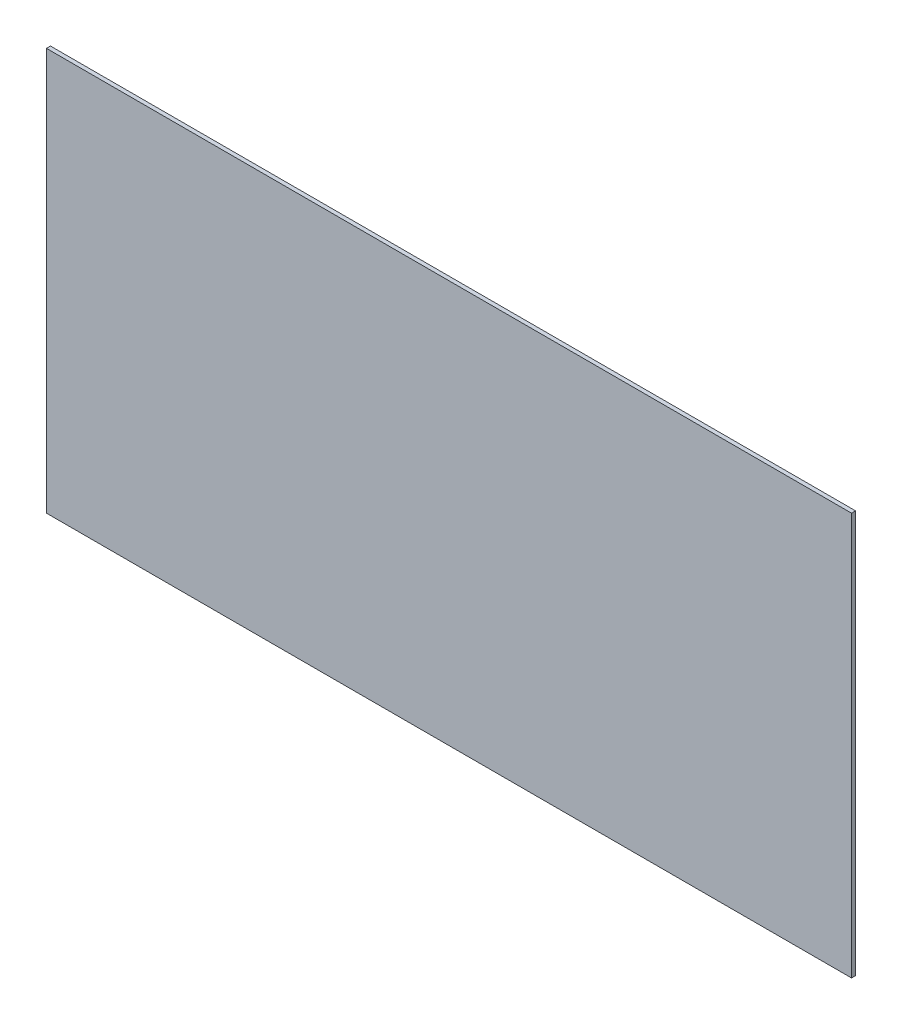
ISO-10303-21;
HEADER;
FILE_DESCRIPTION(('STEP AP214'),'2;1');
FILE_NAME('part.step','',(''),(''),'','','');
FILE_SCHEMA(('AUTOMOTIVE_DESIGN { 1 0 10303 214 1 1 1 1 }'));
ENDSEC;
DATA;
#1=APPLICATION_CONTEXT('core data for automotive mechanical design processes');
#2=APPLICATION_PROTOCOL_DEFINITION('international standard','automotive_design',2000,#1);
#3=PRODUCT_CONTEXT('',#1,'mechanical');
#4=PRODUCT('Part','Part','',(#3));
#5=PRODUCT_RELATED_PRODUCT_CATEGORY('part','',(#4));
#6=PRODUCT_DEFINITION_FORMATION('','',#4);
#7=PRODUCT_DEFINITION_CONTEXT('part definition',#1,'design');
#8=PRODUCT_DEFINITION('design','',#6,#7);
#9=PRODUCT_DEFINITION_SHAPE('','',#8);
#10=(LENGTH_UNIT() NAMED_UNIT(*) SI_UNIT(.MILLI.,.METRE.));
#11=(NAMED_UNIT(*) PLANE_ANGLE_UNIT() SI_UNIT($,.RADIAN.));
#12=(NAMED_UNIT(*) SI_UNIT($,.STERADIAN.) SOLID_ANGLE_UNIT());
#13=UNCERTAINTY_MEASURE_WITH_UNIT(LENGTH_MEASURE(1.E-05),#10,'distance_accuracy_value','');
#14=(GEOMETRIC_REPRESENTATION_CONTEXT(3) GLOBAL_UNCERTAINTY_ASSIGNED_CONTEXT((#13)) GLOBAL_UNIT_ASSIGNED_CONTEXT((#10,
#11,#12)) REPRESENTATION_CONTEXT('',''));
#15=CARTESIAN_POINT('',(0.,0.,0.));
#16=DIRECTION('',(0.,0.,1.));
#17=DIRECTION('',(1.,0.,0.));
#18=AXIS2_PLACEMENT_3D('',#15,#16,#17);
#19=CARTESIAN_POINT('',(0.,1000.,-10.));
#20=DIRECTION('',(-1.,0.,0.));
#21=DIRECTION('',(0.,-1.,0.));
#22=AXIS2_PLACEMENT_3D('',#19,#20,#21);
#23=PLANE('',#22);
#24=DIRECTION('',(0.,-1.,0.));
#25=VECTOR('',#24,1.);
#26=CARTESIAN_POINT('',(0.,1000.,0.));
#27=LINE('',#26,#25);
#28=CARTESIAN_POINT('',(0.,1000.,0.));
#29=VERTEX_POINT('',#28);
#30=CARTESIAN_POINT('',(0.,0.,0.));
#31=VERTEX_POINT('',#30);
#32=EDGE_CURVE('E103',#29,#31,#27,.T.);
#33=ORIENTED_EDGE('',*,*,#32,.F.);
#34=DIRECTION('',(0.,0.,1.));
#35=VECTOR('',#34,1.);
#36=CARTESIAN_POINT('',(0.,1000.,-10.));
#37=LINE('',#36,#35);
#38=CARTESIAN_POINT('',(0.,1000.,-10.));
#39=VERTEX_POINT('',#38);
#40=EDGE_CURVE('E11',#39,#29,#37,.T.);
#41=ORIENTED_EDGE('',*,*,#40,.F.);
#42=DIRECTION('',(0.,-1.,0.));
#43=VECTOR('',#42,1.);
#44=CARTESIAN_POINT('',(0.,1000.,-10.));
#45=LINE('',#44,#43);
#46=CARTESIAN_POINT('',(0.,0.,-10.));
#47=VERTEX_POINT('',#46);
#48=EDGE_CURVE('E97',#39,#47,#45,.T.);
#49=ORIENTED_EDGE('',*,*,#48,.T.);
#50=DIRECTION('',(0.,0.,1.));
#51=VECTOR('',#50,1.);
#52=CARTESIAN_POINT('',(0.,0.,-10.));
#53=LINE('',#52,#51);
#54=EDGE_CURVE('E42',#47,#31,#53,.T.);
#55=ORIENTED_EDGE('',*,*,#54,.T.);
#56=EDGE_LOOP('',(#33,#41,#49,#55));
#57=FACE_BOUND('',#56,.T.);
#58=ADVANCED_FACE('F39',(#57),#23,.T.);
#59=CARTESIAN_POINT('',(2000.,1000.,-10.));
#60=DIRECTION('',(0.,1.,0.));
#61=DIRECTION('',(-1.,0.,0.));
#62=AXIS2_PLACEMENT_3D('',#59,#60,#61);
#63=PLANE('',#62);
#64=DIRECTION('',(-1.,0.,0.));
#65=VECTOR('',#64,1.);
#66=CARTESIAN_POINT('',(2000.,1000.,0.));
#67=LINE('',#66,#65);
#68=CARTESIAN_POINT('',(2000.,1000.,0.));
#69=VERTEX_POINT('',#68);
#70=EDGE_CURVE('E99',#69,#29,#67,.T.);
#71=ORIENTED_EDGE('',*,*,#70,.F.);
#72=DIRECTION('',(0.,0.,1.));
#73=VECTOR('',#72,1.);
#74=CARTESIAN_POINT('',(2000.,1000.,-10.));
#75=LINE('',#74,#73);
#76=CARTESIAN_POINT('',(2000.,1000.,-10.));
#77=VERTEX_POINT('',#76);
#78=EDGE_CURVE('E48',#77,#69,#75,.T.);
#79=ORIENTED_EDGE('',*,*,#78,.F.);
#80=DIRECTION('',(-1.,0.,0.));
#81=VECTOR('',#80,1.);
#82=CARTESIAN_POINT('',(2000.,1000.,-10.));
#83=LINE('',#82,#81);
#84=EDGE_CURVE('E94',#77,#39,#83,.T.);
#85=ORIENTED_EDGE('',*,*,#84,.T.);
#86=ORIENTED_EDGE('',*,*,#40,.T.);
#87=EDGE_LOOP('',(#71,#79,#85,#86));
#88=FACE_BOUND('',#87,.T.);
#89=ADVANCED_FACE('F113',(#88),#63,.T.);
#90=CARTESIAN_POINT('',(2000.,0.,-10.));
#91=DIRECTION('',(1.,0.,0.));
#92=DIRECTION('',(0.,0.,-1.));
#93=AXIS2_PLACEMENT_3D('',#90,#91,#92);
#94=PLANE('',#93);
#95=DIRECTION('',(0.,1.,0.));
#96=VECTOR('',#95,1.);
#97=CARTESIAN_POINT('',(2000.,0.,0.));
#98=LINE('',#97,#96);
#99=CARTESIAN_POINT('',(2000.,0.,0.));
#100=VERTEX_POINT('',#99);
#101=EDGE_CURVE('E89',#100,#69,#98,.T.);
#102=ORIENTED_EDGE('',*,*,#101,.F.);
#103=DIRECTION('',(0.,0.,1.));
#104=VECTOR('',#103,1.);
#105=CARTESIAN_POINT('',(2000.,0.,-10.));
#106=LINE('',#105,#104);
#107=CARTESIAN_POINT('',(2000.,0.,-10.));
#108=VERTEX_POINT('',#107);
#109=EDGE_CURVE('E84',#108,#100,#106,.T.);
#110=ORIENTED_EDGE('',*,*,#109,.F.);
#111=DIRECTION('',(0.,1.,0.));
#112=VECTOR('',#111,1.);
#113=CARTESIAN_POINT('',(2000.,0.,-10.));
#114=LINE('',#113,#112);
#115=EDGE_CURVE('E87',#108,#77,#114,.T.);
#116=ORIENTED_EDGE('',*,*,#115,.T.);
#117=ORIENTED_EDGE('',*,*,#78,.T.);
#118=EDGE_LOOP('',(#102,#110,#116,#117));
#119=FACE_BOUND('',#118,.T.);
#120=ADVANCED_FACE('F86',(#119),#94,.T.);
#121=CARTESIAN_POINT('',(0.,0.,-10.));
#122=DIRECTION('',(0.,-1.,0.));
#123=DIRECTION('',(0.,0.,-1.));
#124=AXIS2_PLACEMENT_3D('',#121,#122,#123);
#125=PLANE('',#124);
#126=DIRECTION('',(1.,0.,0.));
#127=VECTOR('',#126,1.);
#128=CARTESIAN_POINT('',(0.,0.,0.));
#129=LINE('',#128,#127);
#130=EDGE_CURVE('E106',#31,#100,#129,.T.);
#131=ORIENTED_EDGE('',*,*,#130,.F.);
#132=ORIENTED_EDGE('',*,*,#54,.F.);
#133=DIRECTION('',(1.,0.,0.));
#134=VECTOR('',#133,1.);
#135=CARTESIAN_POINT('',(0.,0.,-10.));
#136=LINE('',#135,#134);
#137=EDGE_CURVE('E93',#47,#108,#136,.T.);
#138=ORIENTED_EDGE('',*,*,#137,.T.);
#139=ORIENTED_EDGE('',*,*,#109,.T.);
#140=EDGE_LOOP('',(#131,#132,#138,#139));
#141=FACE_BOUND('',#140,.T.);
#142=ADVANCED_FACE('F96',(#141),#125,.T.);
#143=CARTESIAN_POINT('',(0.,0.,-10.));
#144=DIRECTION('',(0.,0.,1.));
#145=DIRECTION('',(1.,0.,0.));
#146=AXIS2_PLACEMENT_3D('',#143,#144,#145);
#147=PLANE('',#146);
#148=ORIENTED_EDGE('',*,*,#48,.F.);
#149=ORIENTED_EDGE('',*,*,#84,.F.);
#150=ORIENTED_EDGE('',*,*,#115,.F.);
#151=ORIENTED_EDGE('',*,*,#137,.F.);
#152=EDGE_LOOP('',(#148,#149,#150,#151));
#153=FACE_BOUND('',#152,.T.);
#154=ADVANCED_FACE('F92',(#153),#147,.F.);
#155=CARTESIAN_POINT('',(0.,0.,0.));
#156=DIRECTION('',(0.,0.,1.));
#157=DIRECTION('',(1.,0.,0.));
#158=AXIS2_PLACEMENT_3D('',#155,#156,#157);
#159=PLANE('',#158);
#160=ORIENTED_EDGE('',*,*,#32,.T.);
#161=ORIENTED_EDGE('',*,*,#130,.T.);
#162=ORIENTED_EDGE('',*,*,#101,.T.);
#163=ORIENTED_EDGE('',*,*,#70,.T.);
#164=EDGE_LOOP('',(#160,#161,#162,#163));
#165=FACE_BOUND('',#164,.T.);
#166=ADVANCED_FACE('F112',(#165),#159,.T.);
#167=CLOSED_SHELL('',(#58,#89,#120,#142,#154,#166));
#168=MANIFOLD_SOLID_BREP('B2',#167);
#169=ADVANCED_BREP_SHAPE_REPRESENTATION('',(#18,#168),#14);
#170=SHAPE_DEFINITION_REPRESENTATION(#9,#169);
ENDSEC;
END-ISO-10303-21;
